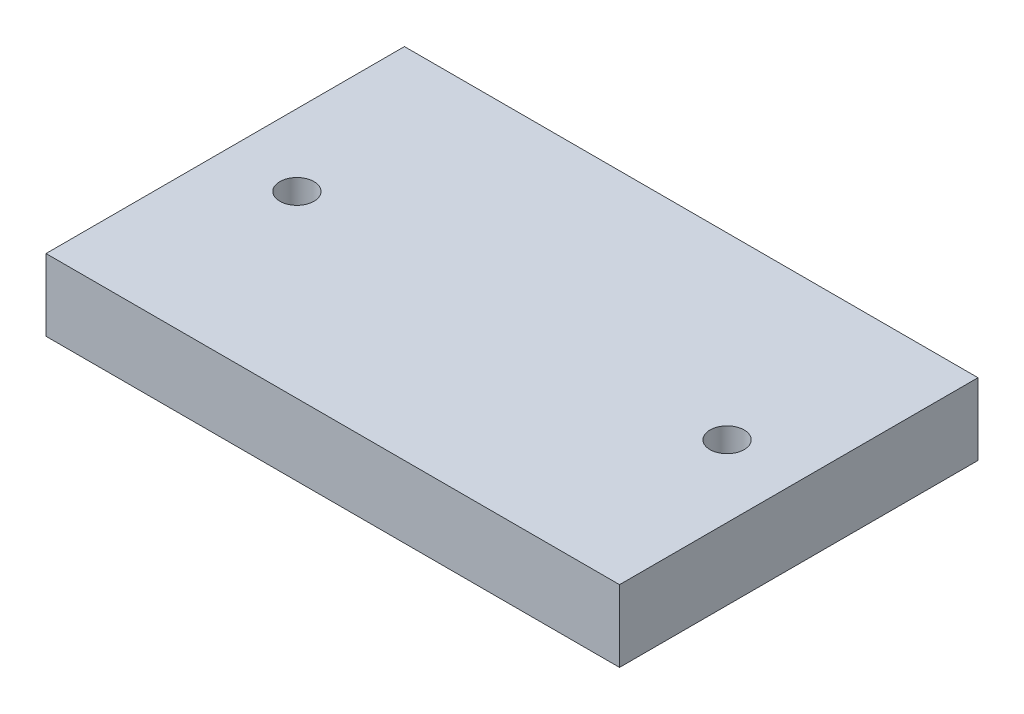
ISO-10303-21;
HEADER;
FILE_DESCRIPTION(('STEP AP214'),'2;1');
FILE_NAME('part.step','',(''),(''),'','','');
FILE_SCHEMA(('AUTOMOTIVE_DESIGN { 1 0 10303 214 1 1 1 1 }'));
ENDSEC;
DATA;
#1=APPLICATION_CONTEXT('core data for automotive mechanical design processes');
#2=APPLICATION_PROTOCOL_DEFINITION('international standard','automotive_design',2000,#1);
#3=PRODUCT_CONTEXT('',#1,'mechanical');
#4=PRODUCT('Part','Part','',(#3));
#5=PRODUCT_RELATED_PRODUCT_CATEGORY('part','',(#4));
#6=PRODUCT_DEFINITION_FORMATION('','',#4);
#7=PRODUCT_DEFINITION_CONTEXT('part definition',#1,'design');
#8=PRODUCT_DEFINITION('design','',#6,#7);
#9=PRODUCT_DEFINITION_SHAPE('','',#8);
#10=(LENGTH_UNIT() NAMED_UNIT(*) SI_UNIT(.MILLI.,.METRE.));
#11=(NAMED_UNIT(*) PLANE_ANGLE_UNIT() SI_UNIT($,.RADIAN.));
#12=(NAMED_UNIT(*) SI_UNIT($,.STERADIAN.) SOLID_ANGLE_UNIT());
#13=UNCERTAINTY_MEASURE_WITH_UNIT(LENGTH_MEASURE(1.E-05),#10,'distance_accuracy_value','');
#14=(GEOMETRIC_REPRESENTATION_CONTEXT(3) GLOBAL_UNCERTAINTY_ASSIGNED_CONTEXT((#13)) GLOBAL_UNIT_ASSIGNED_CONTEXT((#10,
#11,#12)) REPRESENTATION_CONTEXT('',''));
#15=CARTESIAN_POINT('',(0.,0.,0.));
#16=DIRECTION('',(0.,0.,1.));
#17=DIRECTION('',(1.,0.,0.));
#18=AXIS2_PLACEMENT_3D('',#15,#16,#17);
#19=CARTESIAN_POINT('',(40.,10.,25.));
#20=DIRECTION('',(-1.,0.,0.));
#21=DIRECTION('',(0.,0.,1.));
#22=AXIS2_PLACEMENT_3D('',#19,#20,#21);
#23=PLANE('',#22);
#24=DIRECTION('',(0.,0.,-1.));
#25=VECTOR('',#24,1.);
#26=CARTESIAN_POINT('',(40.,0.,25.));
#27=LINE('',#26,#25);
#28=CARTESIAN_POINT('',(40.,0.,25.));
#29=VERTEX_POINT('',#28);
#30=CARTESIAN_POINT('',(40.,0.,-25.));
#31=VERTEX_POINT('',#30);
#32=EDGE_CURVE('E95',#29,#31,#27,.T.);
#33=ORIENTED_EDGE('',*,*,#32,.T.);
#34=DIRECTION('',(0.,-1.,0.));
#35=VECTOR('',#34,1.);
#36=CARTESIAN_POINT('',(40.,10.,-25.));
#37=LINE('',#36,#35);
#38=CARTESIAN_POINT('',(40.,10.,-25.));
#39=VERTEX_POINT('',#38);
#40=EDGE_CURVE('E11',#39,#31,#37,.T.);
#41=ORIENTED_EDGE('',*,*,#40,.F.);
#42=DIRECTION('',(0.,0.,-1.));
#43=VECTOR('',#42,1.);
#44=CARTESIAN_POINT('',(40.,10.,25.));
#45=LINE('',#44,#43);
#46=CARTESIAN_POINT('',(40.,10.,25.));
#47=VERTEX_POINT('',#46);
#48=EDGE_CURVE('E83',#47,#39,#45,.T.);
#49=ORIENTED_EDGE('',*,*,#48,.F.);
#50=DIRECTION('',(0.,-1.,0.));
#51=VECTOR('',#50,1.);
#52=CARTESIAN_POINT('',(40.,10.,25.));
#53=LINE('',#52,#51);
#54=EDGE_CURVE('E91',#47,#29,#53,.T.);
#55=ORIENTED_EDGE('',*,*,#54,.T.);
#56=EDGE_LOOP('',(#33,#41,#49,#55));
#57=FACE_BOUND('',#56,.T.);
#58=ADVANCED_FACE('F32',(#57),#23,.F.);
#59=CARTESIAN_POINT('',(-40.,10.,-25.));
#60=DIRECTION('',(0.,0.,1.));
#61=DIRECTION('',(1.,0.,0.));
#62=AXIS2_PLACEMENT_3D('',#59,#60,#61);
#63=PLANE('',#62);
#64=DIRECTION('',(-1.,0.,0.));
#65=VECTOR('',#64,1.);
#66=CARTESIAN_POINT('',(-40.,0.,-25.));
#67=LINE('',#66,#65);
#68=CARTESIAN_POINT('',(-40.,0.,-25.));
#69=VERTEX_POINT('',#68);
#70=EDGE_CURVE('E87',#31,#69,#67,.T.);
#71=ORIENTED_EDGE('',*,*,#70,.T.);
#72=DIRECTION('',(0.,-1.,0.));
#73=VECTOR('',#72,1.);
#74=CARTESIAN_POINT('',(-40.,10.,-25.));
#75=LINE('',#74,#73);
#76=CARTESIAN_POINT('',(-40.,10.,-25.));
#77=VERTEX_POINT('',#76);
#78=EDGE_CURVE('E40',#77,#69,#75,.T.);
#79=ORIENTED_EDGE('',*,*,#78,.F.);
#80=DIRECTION('',(-1.,0.,0.));
#81=VECTOR('',#80,1.);
#82=CARTESIAN_POINT('',(-40.,10.,-25.));
#83=LINE('',#82,#81);
#84=EDGE_CURVE('E78',#39,#77,#83,.T.);
#85=ORIENTED_EDGE('',*,*,#84,.F.);
#86=ORIENTED_EDGE('',*,*,#40,.T.);
#87=EDGE_LOOP('',(#71,#79,#85,#86));
#88=FACE_BOUND('',#87,.T.);
#89=ADVANCED_FACE('F86',(#88),#63,.F.);
#90=CARTESIAN_POINT('',(-40.,10.,25.));
#91=DIRECTION('',(1.,0.,0.));
#92=DIRECTION('',(0.,0.,-1.));
#93=AXIS2_PLACEMENT_3D('',#90,#91,#92);
#94=PLANE('',#93);
#95=DIRECTION('',(0.,0.,1.));
#96=VECTOR('',#95,1.);
#97=CARTESIAN_POINT('',(-40.,0.,25.));
#98=LINE('',#97,#96);
#99=CARTESIAN_POINT('',(-40.,0.,25.));
#100=VERTEX_POINT('',#99);
#101=EDGE_CURVE('E65',#69,#100,#98,.T.);
#102=ORIENTED_EDGE('',*,*,#101,.T.);
#103=DIRECTION('',(0.,-1.,0.));
#104=VECTOR('',#103,1.);
#105=CARTESIAN_POINT('',(-40.,10.,25.));
#106=LINE('',#105,#104);
#107=CARTESIAN_POINT('',(-40.,10.,25.));
#108=VERTEX_POINT('',#107);
#109=EDGE_CURVE('E88',#108,#100,#106,.T.);
#110=ORIENTED_EDGE('',*,*,#109,.F.);
#111=DIRECTION('',(0.,0.,1.));
#112=VECTOR('',#111,1.);
#113=CARTESIAN_POINT('',(-40.,10.,25.));
#114=LINE('',#113,#112);
#115=EDGE_CURVE('E81',#77,#108,#114,.T.);
#116=ORIENTED_EDGE('',*,*,#115,.F.);
#117=ORIENTED_EDGE('',*,*,#78,.T.);
#118=EDGE_LOOP('',(#102,#110,#116,#117));
#119=FACE_BOUND('',#118,.T.);
#120=ADVANCED_FACE('F89',(#119),#94,.F.);
#121=CARTESIAN_POINT('',(-40.,10.,25.));
#122=DIRECTION('',(0.,0.,-1.));
#123=DIRECTION('',(-1.,0.,0.));
#124=AXIS2_PLACEMENT_3D('',#121,#122,#123);
#125=PLANE('',#124);
#126=DIRECTION('',(1.,0.,0.));
#127=VECTOR('',#126,1.);
#128=CARTESIAN_POINT('',(-40.,0.,25.));
#129=LINE('',#128,#127);
#130=EDGE_CURVE('E71',#100,#29,#129,.T.);
#131=ORIENTED_EDGE('',*,*,#130,.T.);
#132=ORIENTED_EDGE('',*,*,#54,.F.);
#133=DIRECTION('',(1.,0.,0.));
#134=VECTOR('',#133,1.);
#135=CARTESIAN_POINT('',(-40.,10.,25.));
#136=LINE('',#135,#134);
#137=EDGE_CURVE('E48',#108,#47,#136,.T.);
#138=ORIENTED_EDGE('',*,*,#137,.F.);
#139=ORIENTED_EDGE('',*,*,#109,.T.);
#140=EDGE_LOOP('',(#131,#132,#138,#139));
#141=FACE_BOUND('',#140,.T.);
#142=ADVANCED_FACE('F103',(#141),#125,.F.);
#143=CARTESIAN_POINT('',(0.,10.,0.));
#144=DIRECTION('',(0.,-1.,0.));
#145=DIRECTION('',(0.,0.,-1.));
#146=AXIS2_PLACEMENT_3D('',#143,#144,#145);
#147=PLANE('',#146);
#148=CARTESIAN_POINT('',(30.,10.,0.));
#149=DIRECTION('',(0.,1.,0.));
#150=DIRECTION('',(0.,0.,1.));
#151=AXIS2_PLACEMENT_3D('',#148,#149,#150);
#152=CIRCLE('',#151,2.38125);
#153=CARTESIAN_POINT('',(30.,10.,2.38125));
#154=VERTEX_POINT('',#153);
#155=EDGE_CURVE('E115',#154,#154,#152,.T.);
#156=ORIENTED_EDGE('',*,*,#155,.F.);
#157=EDGE_LOOP('',(#156));
#158=FACE_BOUND('',#157,.T.);
#159=CARTESIAN_POINT('',(-30.,10.,0.));
#160=DIRECTION('',(0.,1.,0.));
#161=DIRECTION('',(0.,0.,1.));
#162=AXIS2_PLACEMENT_3D('',#159,#160,#161);
#163=CIRCLE('',#162,2.38125);
#164=CARTESIAN_POINT('',(-30.,10.,2.38125));
#165=VERTEX_POINT('',#164);
#166=EDGE_CURVE('E109',#165,#165,#163,.T.);
#167=ORIENTED_EDGE('',*,*,#166,.F.);
#168=EDGE_LOOP('',(#167));
#169=FACE_BOUND('',#168,.T.);
#170=ORIENTED_EDGE('',*,*,#48,.T.);
#171=ORIENTED_EDGE('',*,*,#84,.T.);
#172=ORIENTED_EDGE('',*,*,#115,.T.);
#173=ORIENTED_EDGE('',*,*,#137,.T.);
#174=EDGE_LOOP('',(#170,#171,#172,#173));
#175=FACE_BOUND('',#174,.T.);
#176=ADVANCED_FACE('F79',(#158,#169,#175),#147,.F.);
#177=CARTESIAN_POINT('',(0.,0.,0.));
#178=DIRECTION('',(0.,-1.,0.));
#179=DIRECTION('',(0.,0.,-1.));
#180=AXIS2_PLACEMENT_3D('',#177,#178,#179);
#181=PLANE('',#180);
#182=CARTESIAN_POINT('',(30.,0.,0.));
#183=DIRECTION('',(0.,1.,0.));
#184=DIRECTION('',(0.,0.,1.));
#185=AXIS2_PLACEMENT_3D('',#182,#183,#184);
#186=CIRCLE('',#185,2.38125);
#187=CARTESIAN_POINT('',(30.,0.,2.38125));
#188=VERTEX_POINT('',#187);
#189=EDGE_CURVE('E112',#188,#188,#186,.T.);
#190=ORIENTED_EDGE('',*,*,#189,.T.);
#191=EDGE_LOOP('',(#190));
#192=FACE_BOUND('',#191,.T.);
#193=CARTESIAN_POINT('',(-30.,0.,0.));
#194=DIRECTION('',(0.,1.,0.));
#195=DIRECTION('',(0.,0.,1.));
#196=AXIS2_PLACEMENT_3D('',#193,#194,#195);
#197=CIRCLE('',#196,2.38125);
#198=CARTESIAN_POINT('',(-30.,0.,2.38125));
#199=VERTEX_POINT('',#198);
#200=EDGE_CURVE('E98',#199,#199,#197,.T.);
#201=ORIENTED_EDGE('',*,*,#200,.T.);
#202=EDGE_LOOP('',(#201));
#203=FACE_BOUND('',#202,.T.);
#204=ORIENTED_EDGE('',*,*,#32,.F.);
#205=ORIENTED_EDGE('',*,*,#130,.F.);
#206=ORIENTED_EDGE('',*,*,#101,.F.);
#207=ORIENTED_EDGE('',*,*,#70,.F.);
#208=EDGE_LOOP('',(#204,#205,#206,#207));
#209=FACE_BOUND('',#208,.T.);
#210=ADVANCED_FACE('F106',(#192,#203,#209),#181,.T.);
#211=CARTESIAN_POINT('',(-30.,0.,0.));
#212=DIRECTION('',(0.,1.,0.));
#213=DIRECTION('',(0.,0.,1.));
#214=AXIS2_PLACEMENT_3D('',#211,#212,#213);
#215=CYLINDRICAL_SURFACE('',#214,2.38125);
#216=ORIENTED_EDGE('',*,*,#200,.F.);
#217=EDGE_LOOP('',(#216));
#218=FACE_BOUND('',#217,.T.);
#219=ORIENTED_EDGE('',*,*,#166,.T.);
#220=EDGE_LOOP('',(#219));
#221=FACE_BOUND('',#220,.T.);
#222=ADVANCED_FACE('F126',(#218,#221),#215,.F.);
#223=CARTESIAN_POINT('',(30.,0.,0.));
#224=DIRECTION('',(0.,1.,0.));
#225=DIRECTION('',(0.,0.,1.));
#226=AXIS2_PLACEMENT_3D('',#223,#224,#225);
#227=CYLINDRICAL_SURFACE('',#226,2.38125);
#228=ORIENTED_EDGE('',*,*,#189,.F.);
#229=EDGE_LOOP('',(#228));
#230=FACE_BOUND('',#229,.T.);
#231=ORIENTED_EDGE('',*,*,#155,.T.);
#232=EDGE_LOOP('',(#231));
#233=FACE_BOUND('',#232,.T.);
#234=ADVANCED_FACE('F123',(#230,#233),#227,.F.);
#235=CLOSED_SHELL('',(#58,#89,#120,#142,#176,#210,#222,#234));
#236=MANIFOLD_SOLID_BREP('B2',#235);
#237=ADVANCED_BREP_SHAPE_REPRESENTATION('',(#18,#236),#14);
#238=SHAPE_DEFINITION_REPRESENTATION(#9,#237);
ENDSEC;
END-ISO-10303-21;
